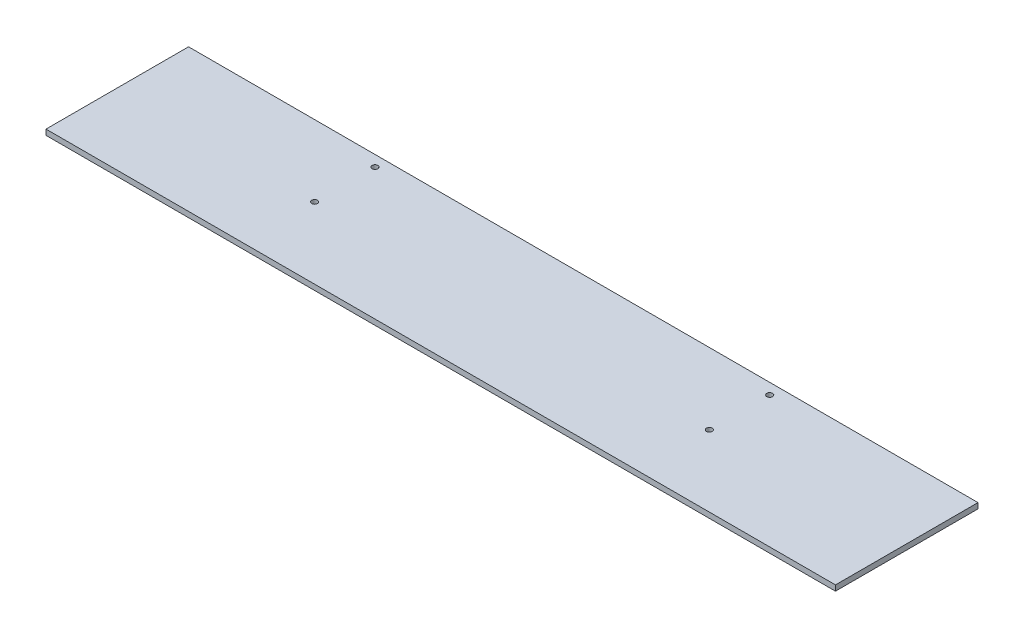
ISO-10303-21;
HEADER;
FILE_DESCRIPTION(('STEP AP214'),'2;1');
FILE_NAME('part.step','',(''),(''),'','','');
FILE_SCHEMA(('AUTOMOTIVE_DESIGN { 1 0 10303 214 1 1 1 1 }'));
ENDSEC;
DATA;
#1=APPLICATION_CONTEXT('core data for automotive mechanical design processes');
#2=APPLICATION_PROTOCOL_DEFINITION('international standard','automotive_design',2000,#1);
#3=PRODUCT_CONTEXT('',#1,'mechanical');
#4=PRODUCT('Part','Part','',(#3));
#5=PRODUCT_RELATED_PRODUCT_CATEGORY('part','',(#4));
#6=PRODUCT_DEFINITION_FORMATION('','',#4);
#7=PRODUCT_DEFINITION_CONTEXT('part definition',#1,'design');
#8=PRODUCT_DEFINITION('design','',#6,#7);
#9=PRODUCT_DEFINITION_SHAPE('','',#8);
#10=(LENGTH_UNIT() NAMED_UNIT(*) SI_UNIT(.MILLI.,.METRE.));
#11=(NAMED_UNIT(*) PLANE_ANGLE_UNIT() SI_UNIT($,.RADIAN.));
#12=(NAMED_UNIT(*) SI_UNIT($,.STERADIAN.) SOLID_ANGLE_UNIT());
#13=UNCERTAINTY_MEASURE_WITH_UNIT(LENGTH_MEASURE(1.E-05),#10,'distance_accuracy_value','');
#14=(GEOMETRIC_REPRESENTATION_CONTEXT(3) GLOBAL_UNCERTAINTY_ASSIGNED_CONTEXT((#13)) GLOBAL_UNIT_ASSIGNED_CONTEXT((#10,
#11,#12)) REPRESENTATION_CONTEXT('',''));
#15=CARTESIAN_POINT('',(0.,0.,0.));
#16=DIRECTION('',(0.,0.,1.));
#17=DIRECTION('',(1.,0.,0.));
#18=AXIS2_PLACEMENT_3D('',#15,#16,#17);
#19=CARTESIAN_POINT('',(457.2,-6.35,-665.126898193359));
#20=DIRECTION('',(0.,0.,1.));
#21=DIRECTION('',(1.,0.,0.));
#22=AXIS2_PLACEMENT_3D('',#19,#20,#21);
#23=PLANE('',#22);
#24=DIRECTION('',(1.,0.,0.));
#25=VECTOR('',#24,1.);
#26=CARTESIAN_POINT('',(457.2,0.,-665.126898193359));
#27=LINE('',#26,#25);
#28=CARTESIAN_POINT('',(0.,0.,-665.126898193359));
#29=VERTEX_POINT('',#28);
#30=CARTESIAN_POINT('',(914.4,0.,-665.126898193359));
#31=VERTEX_POINT('',#30);
#32=EDGE_CURVE('E104',#29,#31,#27,.T.);
#33=ORIENTED_EDGE('',*,*,#32,.F.);
#34=DIRECTION('',(0.,1.,0.));
#35=VECTOR('',#34,1.);
#36=CARTESIAN_POINT('',(0.,-6.35,-665.126898193359));
#37=LINE('',#36,#35);
#38=CARTESIAN_POINT('',(0.,-6.35,-665.126898193359));
#39=VERTEX_POINT('',#38);
#40=EDGE_CURVE('E11',#39,#29,#37,.T.);
#41=ORIENTED_EDGE('',*,*,#40,.F.);
#42=DIRECTION('',(1.,0.,0.));
#43=VECTOR('',#42,1.);
#44=CARTESIAN_POINT('',(457.2,-6.35,-665.126898193359));
#45=LINE('',#44,#43);
#46=CARTESIAN_POINT('',(914.4,-6.35,-665.126898193359));
#47=VERTEX_POINT('',#46);
#48=EDGE_CURVE('E81',#39,#47,#45,.T.);
#49=ORIENTED_EDGE('',*,*,#48,.T.);
#50=DIRECTION('',(0.,1.,0.));
#51=VECTOR('',#50,1.);
#52=CARTESIAN_POINT('',(914.4,-6.35,-665.126898193359));
#53=LINE('',#52,#51);
#54=EDGE_CURVE('E40',#47,#31,#53,.T.);
#55=ORIENTED_EDGE('',*,*,#54,.T.);
#56=EDGE_LOOP('',(#33,#41,#49,#55));
#57=FACE_BOUND('',#56,.T.);
#58=ADVANCED_FACE('F16',(#57),#23,.T.);
#59=CARTESIAN_POINT('',(0.,-6.35,-747.676898193359));
#60=DIRECTION('',(1.,0.,0.));
#61=DIRECTION('',(0.,0.,-1.));
#62=AXIS2_PLACEMENT_3D('',#59,#60,#61);
#63=PLANE('',#62);
#64=DIRECTION('',(0.,0.,-1.));
#65=VECTOR('',#64,1.);
#66=CARTESIAN_POINT('',(0.,0.,-747.676898193359));
#67=LINE('',#66,#65);
#68=CARTESIAN_POINT('',(0.,0.,-830.226898193359));
#69=VERTEX_POINT('',#68);
#70=EDGE_CURVE('E88',#29,#69,#67,.T.);
#71=ORIENTED_EDGE('',*,*,#70,.T.);
#72=DIRECTION('',(0.,1.,0.));
#73=VECTOR('',#72,1.);
#74=CARTESIAN_POINT('',(0.,-6.35,-830.226898193359));
#75=LINE('',#74,#73);
#76=CARTESIAN_POINT('',(0.,-6.35,-830.226898193359));
#77=VERTEX_POINT('',#76);
#78=EDGE_CURVE('E26',#77,#69,#75,.T.);
#79=ORIENTED_EDGE('',*,*,#78,.F.);
#80=DIRECTION('',(0.,0.,-1.));
#81=VECTOR('',#80,1.);
#82=CARTESIAN_POINT('',(0.,-6.35,-747.676898193359));
#83=LINE('',#82,#81);
#84=EDGE_CURVE('E75',#39,#77,#83,.T.);
#85=ORIENTED_EDGE('',*,*,#84,.F.);
#86=ORIENTED_EDGE('',*,*,#40,.T.);
#87=EDGE_LOOP('',(#71,#79,#85,#86));
#88=FACE_BOUND('',#87,.T.);
#89=ADVANCED_FACE('F86',(#88),#63,.F.);
#90=CARTESIAN_POINT('',(457.2,-6.35,-830.226898193359));
#91=DIRECTION('',(0.,0.,1.));
#92=DIRECTION('',(1.,0.,0.));
#93=AXIS2_PLACEMENT_3D('',#90,#91,#92);
#94=PLANE('',#93);
#95=DIRECTION('',(1.,0.,0.));
#96=VECTOR('',#95,1.);
#97=CARTESIAN_POINT('',(457.2,0.,-830.226898193359));
#98=LINE('',#97,#96);
#99=CARTESIAN_POINT('',(914.4,0.,-830.226898193359));
#100=VERTEX_POINT('',#99);
#101=EDGE_CURVE('E110',#69,#100,#98,.T.);
#102=ORIENTED_EDGE('',*,*,#101,.T.);
#103=DIRECTION('',(0.,1.,0.));
#104=VECTOR('',#103,1.);
#105=CARTESIAN_POINT('',(914.4,-6.35,-830.226898193359));
#106=LINE('',#105,#104);
#107=CARTESIAN_POINT('',(914.4,-6.35,-830.226898193359));
#108=VERTEX_POINT('',#107);
#109=EDGE_CURVE('E58',#108,#100,#106,.T.);
#110=ORIENTED_EDGE('',*,*,#109,.F.);
#111=DIRECTION('',(1.,0.,0.));
#112=VECTOR('',#111,1.);
#113=CARTESIAN_POINT('',(457.2,-6.35,-830.226898193359));
#114=LINE('',#113,#112);
#115=EDGE_CURVE('E80',#77,#108,#114,.T.);
#116=ORIENTED_EDGE('',*,*,#115,.F.);
#117=ORIENTED_EDGE('',*,*,#78,.T.);
#118=EDGE_LOOP('',(#102,#110,#116,#117));
#119=FACE_BOUND('',#118,.T.);
#120=ADVANCED_FACE('F93',(#119),#94,.F.);
#121=CARTESIAN_POINT('',(914.4,-6.35,-747.676898193359));
#122=DIRECTION('',(1.,0.,0.));
#123=DIRECTION('',(0.,0.,-1.));
#124=AXIS2_PLACEMENT_3D('',#121,#122,#123);
#125=PLANE('',#124);
#126=DIRECTION('',(0.,0.,-1.));
#127=VECTOR('',#126,1.);
#128=CARTESIAN_POINT('',(914.4,0.,-747.676898193359));
#129=LINE('',#128,#127);
#130=EDGE_CURVE('E113',#31,#100,#129,.T.);
#131=ORIENTED_EDGE('',*,*,#130,.F.);
#132=ORIENTED_EDGE('',*,*,#54,.F.);
#133=DIRECTION('',(0.,0.,-1.));
#134=VECTOR('',#133,1.);
#135=CARTESIAN_POINT('',(914.4,-6.35,-747.676898193359));
#136=LINE('',#135,#134);
#137=EDGE_CURVE('E95',#47,#108,#136,.T.);
#138=ORIENTED_EDGE('',*,*,#137,.T.);
#139=ORIENTED_EDGE('',*,*,#109,.T.);
#140=EDGE_LOOP('',(#131,#132,#138,#139));
#141=FACE_BOUND('',#140,.T.);
#142=ADVANCED_FACE('F154',(#141),#125,.T.);
#143=CARTESIAN_POINT('',(457.2,-6.35,-747.676898193359));
#144=DIRECTION('',(0.,-1.,0.));
#145=DIRECTION('',(1.,0.,0.));
#146=AXIS2_PLACEMENT_3D('',#143,#144,#145);
#147=PLANE('',#146);
#148=CARTESIAN_POINT('',(685.8,-6.35,-747.676898193359));
#149=DIRECTION('',(0.,-1.,0.));
#150=DIRECTION('',(0.,0.,-1.));
#151=AXIS2_PLACEMENT_3D('',#148,#149,#150);
#152=CIRCLE('',#151,3.3655);
#153=CARTESIAN_POINT('',(685.8,-6.35,-751.042398193359));
#154=VERTEX_POINT('',#153);
#155=EDGE_CURVE('E147',#154,#154,#152,.T.);
#156=ORIENTED_EDGE('',*,*,#155,.F.);
#157=EDGE_LOOP('',(#156));
#158=FACE_BOUND('',#157,.T.);
#159=CARTESIAN_POINT('',(685.8,-6.35,-817.526898193359));
#160=DIRECTION('',(0.,-1.,0.));
#161=DIRECTION('',(0.,0.,-1.));
#162=AXIS2_PLACEMENT_3D('',#159,#160,#161);
#163=CIRCLE('',#162,3.3655);
#164=CARTESIAN_POINT('',(685.8,-6.35,-820.892398193359));
#165=VERTEX_POINT('',#164);
#166=EDGE_CURVE('E132',#165,#165,#163,.T.);
#167=ORIENTED_EDGE('',*,*,#166,.F.);
#168=EDGE_LOOP('',(#167));
#169=FACE_BOUND('',#168,.T.);
#170=CARTESIAN_POINT('',(228.6,-6.35,-817.526898193359));
#171=DIRECTION('',(0.,-1.,0.));
#172=DIRECTION('',(0.,0.,-1.));
#173=AXIS2_PLACEMENT_3D('',#170,#171,#172);
#174=CIRCLE('',#173,3.3655);
#175=CARTESIAN_POINT('',(228.6,-6.35,-820.892398193359));
#176=VERTEX_POINT('',#175);
#177=EDGE_CURVE('E128',#176,#176,#174,.T.);
#178=ORIENTED_EDGE('',*,*,#177,.F.);
#179=EDGE_LOOP('',(#178));
#180=FACE_BOUND('',#179,.T.);
#181=CARTESIAN_POINT('',(228.6,-6.35,-747.676898193359));
#182=DIRECTION('',(0.,-1.,0.));
#183=DIRECTION('',(0.,0.,-1.));
#184=AXIS2_PLACEMENT_3D('',#181,#182,#183);
#185=CIRCLE('',#184,3.3655);
#186=CARTESIAN_POINT('',(228.6,-6.35,-751.042398193359));
#187=VERTEX_POINT('',#186);
#188=EDGE_CURVE('E124',#187,#187,#185,.T.);
#189=ORIENTED_EDGE('',*,*,#188,.F.);
#190=EDGE_LOOP('',(#189));
#191=FACE_BOUND('',#190,.T.);
#192=ORIENTED_EDGE('',*,*,#48,.F.);
#193=ORIENTED_EDGE('',*,*,#84,.T.);
#194=ORIENTED_EDGE('',*,*,#115,.T.);
#195=ORIENTED_EDGE('',*,*,#137,.F.);
#196=EDGE_LOOP('',(#192,#193,#194,#195));
#197=FACE_BOUND('',#196,.T.);
#198=ADVANCED_FACE('F77',(#158,#169,#180,#191,#197),#147,.T.);
#199=CARTESIAN_POINT('',(457.2,0.,-747.676898193359));
#200=DIRECTION('',(0.,-1.,0.));
#201=DIRECTION('',(1.,0.,0.));
#202=AXIS2_PLACEMENT_3D('',#199,#200,#201);
#203=PLANE('',#202);
#204=CARTESIAN_POINT('',(685.8,0.,-747.676898193359));
#205=DIRECTION('',(0.,-1.,0.));
#206=DIRECTION('',(0.,0.,-1.));
#207=AXIS2_PLACEMENT_3D('',#204,#205,#206);
#208=CIRCLE('',#207,3.3655);
#209=CARTESIAN_POINT('',(685.8,0.,-751.042398193359));
#210=VERTEX_POINT('',#209);
#211=EDGE_CURVE('E19',#210,#210,#208,.F.);
#212=ORIENTED_EDGE('',*,*,#211,.F.);
#213=EDGE_LOOP('',(#212));
#214=FACE_BOUND('',#213,.T.);
#215=CARTESIAN_POINT('',(685.8,0.,-817.526898193359));
#216=DIRECTION('',(0.,-1.,0.));
#217=DIRECTION('',(0.,0.,-1.));
#218=AXIS2_PLACEMENT_3D('',#215,#216,#217);
#219=CIRCLE('',#218,3.3655);
#220=CARTESIAN_POINT('',(685.8,0.,-820.892398193359));
#221=VERTEX_POINT('',#220);
#222=EDGE_CURVE('E129',#221,#221,#219,.F.);
#223=ORIENTED_EDGE('',*,*,#222,.F.);
#224=EDGE_LOOP('',(#223));
#225=FACE_BOUND('',#224,.T.);
#226=CARTESIAN_POINT('',(228.6,0.,-817.526898193359));
#227=DIRECTION('',(0.,-1.,0.));
#228=DIRECTION('',(0.,0.,-1.));
#229=AXIS2_PLACEMENT_3D('',#226,#227,#228);
#230=CIRCLE('',#229,3.3655);
#231=CARTESIAN_POINT('',(228.6,0.,-820.892398193359));
#232=VERTEX_POINT('',#231);
#233=EDGE_CURVE('E125',#232,#232,#230,.F.);
#234=ORIENTED_EDGE('',*,*,#233,.F.);
#235=EDGE_LOOP('',(#234));
#236=FACE_BOUND('',#235,.T.);
#237=CARTESIAN_POINT('',(228.6,0.,-747.676898193359));
#238=DIRECTION('',(0.,-1.,0.));
#239=DIRECTION('',(0.,0.,-1.));
#240=AXIS2_PLACEMENT_3D('',#237,#238,#239);
#241=CIRCLE('',#240,3.3655);
#242=CARTESIAN_POINT('',(228.6,0.,-751.042398193359));
#243=VERTEX_POINT('',#242);
#244=EDGE_CURVE('E107',#243,#243,#241,.F.);
#245=ORIENTED_EDGE('',*,*,#244,.F.);
#246=EDGE_LOOP('',(#245));
#247=FACE_BOUND('',#246,.T.);
#248=ORIENTED_EDGE('',*,*,#32,.T.);
#249=ORIENTED_EDGE('',*,*,#130,.T.);
#250=ORIENTED_EDGE('',*,*,#101,.F.);
#251=ORIENTED_EDGE('',*,*,#70,.F.);
#252=EDGE_LOOP('',(#248,#249,#250,#251));
#253=FACE_BOUND('',#252,.T.);
#254=ADVANCED_FACE('F163',(#214,#225,#236,#247,#253),#203,.F.);
#255=CARTESIAN_POINT('',(228.6,923.868121694976,-747.676898193359));
#256=DIRECTION('',(0.,-1.,0.));
#257=DIRECTION('',(0.,0.,-1.));
#258=AXIS2_PLACEMENT_3D('',#255,#256,#257);
#259=CYLINDRICAL_SURFACE('',#258,3.3655);
#260=ORIENTED_EDGE('',*,*,#188,.T.);
#261=EDGE_LOOP('',(#260));
#262=FACE_BOUND('',#261,.T.);
#263=ORIENTED_EDGE('',*,*,#244,.T.);
#264=EDGE_LOOP('',(#263));
#265=FACE_BOUND('',#264,.T.);
#266=ADVANCED_FACE('F206',(#262,#265),#259,.F.);
#267=CARTESIAN_POINT('',(228.6,923.868121694976,-817.526898193359));
#268=DIRECTION('',(0.,-1.,0.));
#269=DIRECTION('',(0.,0.,-1.));
#270=AXIS2_PLACEMENT_3D('',#267,#268,#269);
#271=CYLINDRICAL_SURFACE('',#270,3.3655);
#272=ORIENTED_EDGE('',*,*,#177,.T.);
#273=EDGE_LOOP('',(#272));
#274=FACE_BOUND('',#273,.T.);
#275=ORIENTED_EDGE('',*,*,#233,.T.);
#276=EDGE_LOOP('',(#275));
#277=FACE_BOUND('',#276,.T.);
#278=ADVANCED_FACE('F216',(#274,#277),#271,.F.);
#279=CARTESIAN_POINT('',(685.8,923.868121694976,-817.526898193359));
#280=DIRECTION('',(0.,-1.,0.));
#281=DIRECTION('',(0.,0.,-1.));
#282=AXIS2_PLACEMENT_3D('',#279,#280,#281);
#283=CYLINDRICAL_SURFACE('',#282,3.3655);
#284=ORIENTED_EDGE('',*,*,#166,.T.);
#285=EDGE_LOOP('',(#284));
#286=FACE_BOUND('',#285,.T.);
#287=ORIENTED_EDGE('',*,*,#222,.T.);
#288=EDGE_LOOP('',(#287));
#289=FACE_BOUND('',#288,.T.);
#290=ADVANCED_FACE('F227',(#286,#289),#283,.F.);
#291=CARTESIAN_POINT('',(685.8,923.868121694976,-747.676898193359));
#292=DIRECTION('',(0.,-1.,0.));
#293=DIRECTION('',(0.,0.,-1.));
#294=AXIS2_PLACEMENT_3D('',#291,#292,#293);
#295=CYLINDRICAL_SURFACE('',#294,3.3655);
#296=ORIENTED_EDGE('',*,*,#155,.T.);
#297=EDGE_LOOP('',(#296));
#298=FACE_BOUND('',#297,.T.);
#299=ORIENTED_EDGE('',*,*,#211,.T.);
#300=EDGE_LOOP('',(#299));
#301=FACE_BOUND('',#300,.T.);
#302=ADVANCED_FACE('F238',(#298,#301),#295,.F.);
#303=CLOSED_SHELL('',(#58,#89,#120,#142,#198,#254,#266,#278,#290,#302));
#304=MANIFOLD_SOLID_BREP('B1',#303);
#305=ADVANCED_BREP_SHAPE_REPRESENTATION('',(#18,#304),#14);
#306=SHAPE_DEFINITION_REPRESENTATION(#9,#305);
ENDSEC;
END-ISO-10303-21;
